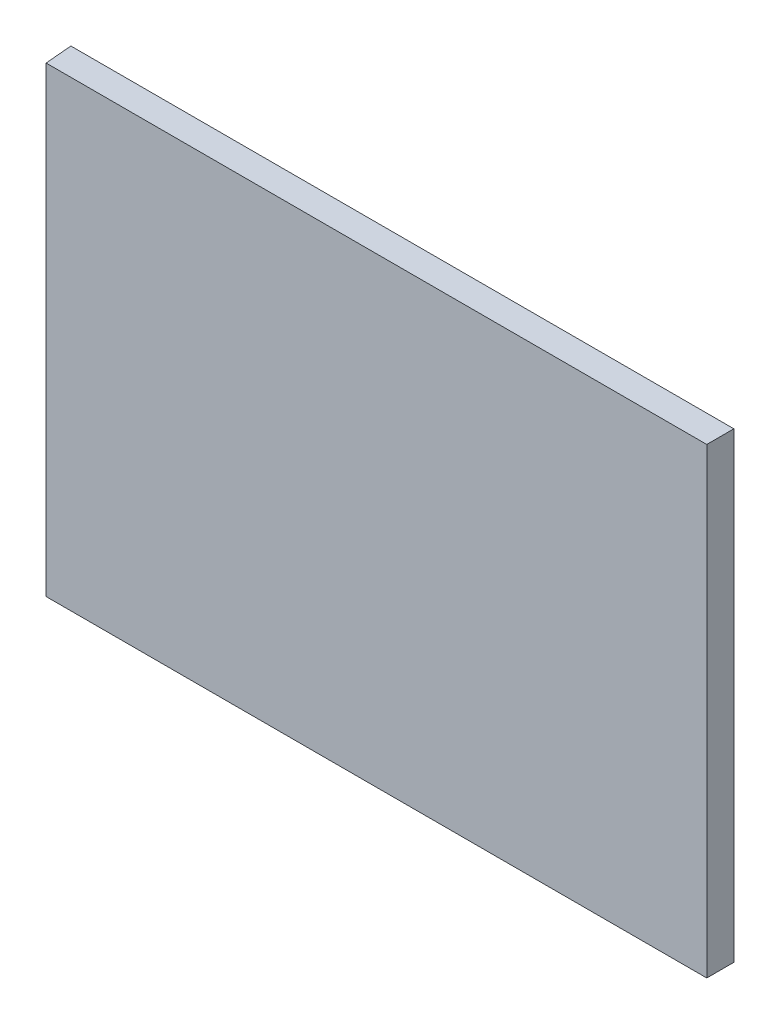
ISO-10303-21;
HEADER;
FILE_DESCRIPTION(('STEP AP214'),'2;1');
FILE_NAME('part.step','',(''),(''),'','','');
FILE_SCHEMA(('AUTOMOTIVE_DESIGN { 1 0 10303 214 1 1 1 1 }'));
ENDSEC;
DATA;
#1=APPLICATION_CONTEXT('core data for automotive mechanical design processes');
#2=APPLICATION_PROTOCOL_DEFINITION('international standard','automotive_design',2000,#1);
#3=PRODUCT_CONTEXT('',#1,'mechanical');
#4=PRODUCT('Part','Part','',(#3));
#5=PRODUCT_RELATED_PRODUCT_CATEGORY('part','',(#4));
#6=PRODUCT_DEFINITION_FORMATION('','',#4);
#7=PRODUCT_DEFINITION_CONTEXT('part definition',#1,'design');
#8=PRODUCT_DEFINITION('design','',#6,#7);
#9=PRODUCT_DEFINITION_SHAPE('','',#8);
#10=(LENGTH_UNIT() NAMED_UNIT(*) SI_UNIT(.MILLI.,.METRE.));
#11=(NAMED_UNIT(*) PLANE_ANGLE_UNIT() SI_UNIT($,.RADIAN.));
#12=(NAMED_UNIT(*) SI_UNIT($,.STERADIAN.) SOLID_ANGLE_UNIT());
#13=UNCERTAINTY_MEASURE_WITH_UNIT(LENGTH_MEASURE(1.E-05),#10,'distance_accuracy_value','');
#14=(GEOMETRIC_REPRESENTATION_CONTEXT(3) GLOBAL_UNCERTAINTY_ASSIGNED_CONTEXT((#13)) GLOBAL_UNIT_ASSIGNED_CONTEXT((#10,
#11,#12)) REPRESENTATION_CONTEXT('',''));
#15=CARTESIAN_POINT('',(0.,0.,0.));
#16=DIRECTION('',(0.,0.,1.));
#17=DIRECTION('',(1.,0.,0.));
#18=AXIS2_PLACEMENT_3D('',#15,#16,#17);
#19=CARTESIAN_POINT('',(0.,0.,1.));
#20=DIRECTION('',(0.,0.,1.));
#21=DIRECTION('',(1.,0.,0.));
#22=AXIS2_PLACEMENT_3D('',#19,#20,#21);
#23=PLANE('',#22);
#24=DIRECTION('',(-1.,0.,0.));
#25=VECTOR('',#24,1.);
#26=CARTESIAN_POINT('',(13.4118723306581,-10.04,1.));
#27=LINE('',#26,#25);
#28=CARTESIAN_POINT('',(13.4118723306581,-10.04,1.));
#29=VERTEX_POINT('',#28);
#30=CARTESIAN_POINT('',(-10.950639005816,-10.04,1.));
#31=VERTEX_POINT('',#30);
#32=EDGE_CURVE('E94',#29,#31,#27,.T.);
#33=ORIENTED_EDGE('',*,*,#32,.F.);
#34=DIRECTION('',(0.,-1.,0.));
#35=VECTOR('',#34,1.);
#36=CARTESIAN_POINT('',(13.4118723306581,7.,1.));
#37=LINE('',#36,#35);
#38=CARTESIAN_POINT('',(13.4118723306581,7.,1.));
#39=VERTEX_POINT('',#38);
#40=EDGE_CURVE('E102',#39,#29,#37,.T.);
#41=ORIENTED_EDGE('',*,*,#40,.F.);
#42=DIRECTION('',(1.,0.,0.));
#43=VECTOR('',#42,1.);
#44=CARTESIAN_POINT('',(-10.950639005816,7.,1.));
#45=LINE('',#44,#43);
#46=CARTESIAN_POINT('',(-10.950639005816,7.,1.));
#47=VERTEX_POINT('',#46);
#48=EDGE_CURVE('E90',#47,#39,#45,.T.);
#49=ORIENTED_EDGE('',*,*,#48,.F.);
#50=DIRECTION('',(0.,1.,0.));
#51=VECTOR('',#50,1.);
#52=CARTESIAN_POINT('',(-10.950639005816,-12.04,1.));
#53=LINE('',#52,#51);
#54=EDGE_CURVE('E51',#31,#47,#53,.T.);
#55=ORIENTED_EDGE('',*,*,#54,.F.);
#56=EDGE_LOOP('',(#33,#41,#49,#55));
#57=FACE_BOUND('',#56,.T.);
#58=ADVANCED_FACE('F42',(#57),#23,.T.);
#59=CARTESIAN_POINT('',(0.,0.,0.));
#60=DIRECTION('',(0.,0.,1.));
#61=DIRECTION('',(1.,0.,0.));
#62=AXIS2_PLACEMENT_3D('',#59,#60,#61);
#63=PLANE('',#62);
#64=DIRECTION('',(0.,-1.,0.));
#65=VECTOR('',#64,1.);
#66=CARTESIAN_POINT('',(-11.0381276693419,9.,0.));
#67=LINE('',#66,#65);
#68=CARTESIAN_POINT('',(-11.0381276693419,7.,0.));
#69=VERTEX_POINT('',#68);
#70=CARTESIAN_POINT('',(-11.0381276693419,-10.04,0.));
#71=VERTEX_POINT('',#70);
#72=EDGE_CURVE('E11',#69,#71,#67,.T.);
#73=ORIENTED_EDGE('',*,*,#72,.F.);
#74=DIRECTION('',(-1.,0.,0.));
#75=VECTOR('',#74,1.);
#76=CARTESIAN_POINT('',(-10.950639005816,7.,0.));
#77=LINE('',#76,#75);
#78=CARTESIAN_POINT('',(13.4118723306581,7.,0.));
#79=VERTEX_POINT('',#78);
#80=EDGE_CURVE('E107',#79,#69,#77,.T.);
#81=ORIENTED_EDGE('',*,*,#80,.F.);
#82=DIRECTION('',(0.,1.,0.));
#83=VECTOR('',#82,1.);
#84=CARTESIAN_POINT('',(13.4118723306581,7.,0.));
#85=LINE('',#84,#83);
#86=CARTESIAN_POINT('',(13.4118723306581,-10.04,0.));
#87=VERTEX_POINT('',#86);
#88=EDGE_CURVE('E65',#87,#79,#85,.T.);
#89=ORIENTED_EDGE('',*,*,#88,.F.);
#90=DIRECTION('',(1.,0.,0.));
#91=VECTOR('',#90,1.);
#92=CARTESIAN_POINT('',(13.4118723306581,-10.04,0.));
#93=LINE('',#92,#91);
#94=EDGE_CURVE('E58',#71,#87,#93,.T.);
#95=ORIENTED_EDGE('',*,*,#94,.F.);
#96=EDGE_LOOP('',(#73,#81,#89,#95));
#97=FACE_BOUND('',#96,.T.);
#98=ADVANCED_FACE('F44',(#97),#63,.F.);
#99=CARTESIAN_POINT('',(-10.950639005816,-12.04,1.));
#100=DIRECTION('',(0.996194698091746,0.,-0.0871557427476526));
#101=DIRECTION('',(-0.0871557427476526,0.,-0.996194698091746));
#102=AXIS2_PLACEMENT_3D('',#99,#100,#101);
#103=PLANE('',#102);
#104=ORIENTED_EDGE('',*,*,#54,.T.);
#105=DIRECTION('',(-0.0871557427476526,0.,-0.996194698091746));
#106=VECTOR('',#105,1.);
#107=CARTESIAN_POINT('',(-10.950639005816,7.,1.));
#108=LINE('',#107,#106);
#109=EDGE_CURVE('E91',#47,#69,#108,.T.);
#110=ORIENTED_EDGE('',*,*,#109,.T.);
#111=ORIENTED_EDGE('',*,*,#72,.T.);
#112=DIRECTION('',(0.0871557427476526,0.,0.996194698091746));
#113=VECTOR('',#112,1.);
#114=CARTESIAN_POINT('',(-10.950639005816,-10.04,1.));
#115=LINE('',#114,#113);
#116=EDGE_CURVE('E83',#71,#31,#115,.T.);
#117=ORIENTED_EDGE('',*,*,#116,.T.);
#118=EDGE_LOOP('',(#104,#110,#111,#117));
#119=FACE_BOUND('',#118,.T.);
#120=ADVANCED_FACE('F85',(#119),#103,.F.);
#121=CARTESIAN_POINT('',(13.4118723306581,-10.04,-33.3399324028896));
#122=DIRECTION('',(0.,1.,0.));
#123=DIRECTION('',(-1.,0.,0.));
#124=AXIS2_PLACEMENT_3D('',#121,#122,#123);
#125=PLANE('',#124);
#126=ORIENTED_EDGE('',*,*,#94,.T.);
#127=DIRECTION('',(0.,0.,1.));
#128=VECTOR('',#127,1.);
#129=CARTESIAN_POINT('',(13.4118723306581,-10.04,-33.3399324028896));
#130=LINE('',#129,#128);
#131=EDGE_CURVE('E96',#87,#29,#130,.T.);
#132=ORIENTED_EDGE('',*,*,#131,.T.);
#133=ORIENTED_EDGE('',*,*,#32,.T.);
#134=ORIENTED_EDGE('',*,*,#116,.F.);
#135=EDGE_LOOP('',(#126,#132,#133,#134));
#136=FACE_BOUND('',#135,.T.);
#137=ADVANCED_FACE('F95',(#136),#125,.F.);
#138=CARTESIAN_POINT('',(13.4118723306581,7.,-33.3399324028896));
#139=DIRECTION('',(-1.,0.,0.));
#140=DIRECTION('',(0.,0.,1.));
#141=AXIS2_PLACEMENT_3D('',#138,#139,#140);
#142=PLANE('',#141);
#143=ORIENTED_EDGE('',*,*,#88,.T.);
#144=DIRECTION('',(0.,0.,1.));
#145=VECTOR('',#144,1.);
#146=CARTESIAN_POINT('',(13.4118723306581,7.,-33.3399324028896));
#147=LINE('',#146,#145);
#148=EDGE_CURVE('E101',#79,#39,#147,.T.);
#149=ORIENTED_EDGE('',*,*,#148,.T.);
#150=ORIENTED_EDGE('',*,*,#40,.T.);
#151=ORIENTED_EDGE('',*,*,#131,.F.);
#152=EDGE_LOOP('',(#143,#149,#150,#151));
#153=FACE_BOUND('',#152,.T.);
#154=ADVANCED_FACE('F128',(#153),#142,.F.);
#155=CARTESIAN_POINT('',(-10.950639005816,7.,-33.3399324028896));
#156=DIRECTION('',(0.,-1.,0.));
#157=DIRECTION('',(0.,0.,-1.));
#158=AXIS2_PLACEMENT_3D('',#155,#156,#157);
#159=PLANE('',#158);
#160=ORIENTED_EDGE('',*,*,#80,.T.);
#161=ORIENTED_EDGE('',*,*,#109,.F.);
#162=ORIENTED_EDGE('',*,*,#48,.T.);
#163=ORIENTED_EDGE('',*,*,#148,.F.);
#164=EDGE_LOOP('',(#160,#161,#162,#163));
#165=FACE_BOUND('',#164,.T.);
#166=ADVANCED_FACE('F127',(#165),#159,.F.);
#167=CLOSED_SHELL('',(#58,#98,#120,#137,#154,#166));
#168=MANIFOLD_SOLID_BREP('B2',#167);
#169=ADVANCED_BREP_SHAPE_REPRESENTATION('',(#18,#168),#14);
#170=SHAPE_DEFINITION_REPRESENTATION(#9,#169);
ENDSEC;
END-ISO-10303-21;
